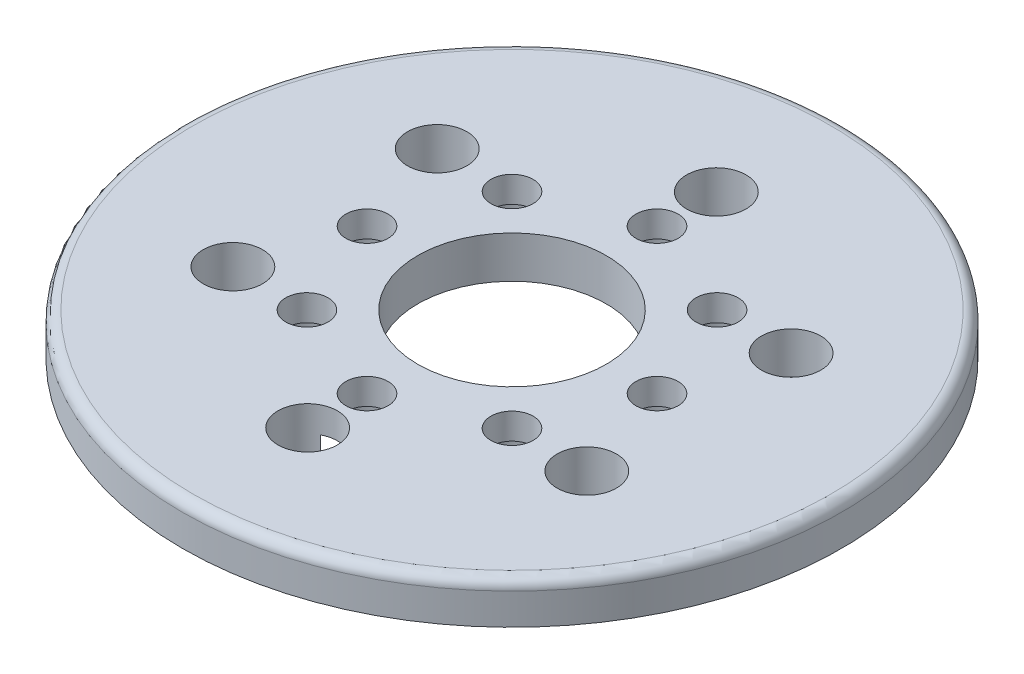
ISO-10303-21;
HEADER;
FILE_DESCRIPTION(('STEP AP214'),'2;1');
FILE_NAME('part.step','',(''),(''),'','','');
FILE_SCHEMA(('AUTOMOTIVE_DESIGN { 1 0 10303 214 1 1 1 1 }'));
ENDSEC;
DATA;
#1=APPLICATION_CONTEXT('core data for automotive mechanical design processes');
#2=APPLICATION_PROTOCOL_DEFINITION('international standard','automotive_design',2000,#1);
#3=PRODUCT_CONTEXT('',#1,'mechanical');
#4=PRODUCT('Part','Part','',(#3));
#5=PRODUCT_RELATED_PRODUCT_CATEGORY('part','',(#4));
#6=PRODUCT_DEFINITION_FORMATION('','',#4);
#7=PRODUCT_DEFINITION_CONTEXT('part definition',#1,'design');
#8=PRODUCT_DEFINITION('design','',#6,#7);
#9=PRODUCT_DEFINITION_SHAPE('','',#8);
#10=(LENGTH_UNIT() NAMED_UNIT(*) SI_UNIT(.MILLI.,.METRE.));
#11=(NAMED_UNIT(*) PLANE_ANGLE_UNIT() SI_UNIT($,.RADIAN.));
#12=(NAMED_UNIT(*) SI_UNIT($,.STERADIAN.) SOLID_ANGLE_UNIT());
#13=UNCERTAINTY_MEASURE_WITH_UNIT(LENGTH_MEASURE(1.E-05),#10,'distance_accuracy_value','');
#14=(GEOMETRIC_REPRESENTATION_CONTEXT(3) GLOBAL_UNCERTAINTY_ASSIGNED_CONTEXT((#13)) GLOBAL_UNIT_ASSIGNED_CONTEXT((#10,
#11,#12)) REPRESENTATION_CONTEXT('',''));
#15=CARTESIAN_POINT('',(0.,0.,0.));
#16=DIRECTION('',(0.,0.,1.));
#17=DIRECTION('',(1.,0.,0.));
#18=AXIS2_PLACEMENT_3D('',#15,#16,#17);
#19=CARTESIAN_POINT('',(7.77817459305193,3.175,7.77817459305212));
#20=DIRECTION('',(0.,-1.,0.));
#21=DIRECTION('',(0.,0.,-1.));
#22=AXIS2_PLACEMENT_3D('',#19,#20,#21);
#23=CYLINDRICAL_SURFACE('',#22,1.6);
#24=CARTESIAN_POINT('',(7.77817459305193,3.175,7.77817459305212));
#25=DIRECTION('',(0.,-1.,0.));
#26=DIRECTION('',(-0.707106781186539,0.,-0.707106781186556));
#27=AXIS2_PLACEMENT_3D('',#24,#25,#26);
#28=CIRCLE('',#27,1.6);
#29=CARTESIAN_POINT('',(6.64680374315347,3.175,6.64680374315363));
#30=VERTEX_POINT('',#29);
#31=EDGE_CURVE('E123',#30,#30,#28,.T.);
#32=ORIENTED_EDGE('',*,*,#31,.F.);
#33=EDGE_LOOP('',(#32));
#34=FACE_BOUND('',#33,.T.);
#35=CARTESIAN_POINT('',(7.77817459305193,1.2,7.77817459305212));
#36=DIRECTION('',(0.,-1.,0.));
#37=DIRECTION('',(0.,0.,-1.));
#38=AXIS2_PLACEMENT_3D('',#35,#36,#37);
#39=CIRCLE('',#38,1.6);
#40=CARTESIAN_POINT('',(7.77817459305193,1.2,6.17817459305212));
#41=VERTEX_POINT('',#40);
#42=EDGE_CURVE('E147',#41,#41,#39,.F.);
#43=ORIENTED_EDGE('',*,*,#42,.F.);
#44=EDGE_LOOP('',(#43));
#45=FACE_BOUND('',#44,.T.);
#46=ADVANCED_FACE('F32',(#34,#45),#23,.F.);
#47=CARTESIAN_POINT('',(11.,3.175,1.15218884181823E-13));
#48=DIRECTION('',(0.,-1.,0.));
#49=DIRECTION('',(0.,0.,-1.));
#50=AXIS2_PLACEMENT_3D('',#47,#48,#49);
#51=CYLINDRICAL_SURFACE('',#50,1.6);
#52=CARTESIAN_POINT('',(11.,3.175,1.15218884181823E-13));
#53=DIRECTION('',(0.,-1.,0.));
#54=DIRECTION('',(-1.,0.,0.));
#55=AXIS2_PLACEMENT_3D('',#52,#53,#54);
#56=CIRCLE('',#55,1.6);
#57=CARTESIAN_POINT('',(9.4,3.175,0.));
#58=VERTEX_POINT('',#57);
#59=EDGE_CURVE('E538',#58,#58,#56,.T.);
#60=ORIENTED_EDGE('',*,*,#59,.F.);
#61=EDGE_LOOP('',(#60));
#62=FACE_BOUND('',#61,.T.);
#63=CARTESIAN_POINT('',(11.,1.2,1.15218884181823E-13));
#64=DIRECTION('',(0.,-1.,0.));
#65=DIRECTION('',(0.,0.,-1.));
#66=AXIS2_PLACEMENT_3D('',#63,#64,#65);
#67=CIRCLE('',#66,1.6);
#68=CARTESIAN_POINT('',(11.,1.2,-1.59999999999989));
#69=VERTEX_POINT('',#68);
#70=EDGE_CURVE('E142',#69,#69,#67,.F.);
#71=ORIENTED_EDGE('',*,*,#70,.F.);
#72=EDGE_LOOP('',(#71));
#73=FACE_BOUND('',#72,.T.);
#74=ADVANCED_FACE('F168',(#62,#73),#51,.F.);
#75=CARTESIAN_POINT('',(7.77817459305209,3.175,-7.77817459305195));
#76=DIRECTION('',(0.,-1.,0.));
#77=DIRECTION('',(0.,0.,-1.));
#78=AXIS2_PLACEMENT_3D('',#75,#76,#77);
#79=CYLINDRICAL_SURFACE('',#78,1.6);
#80=CARTESIAN_POINT('',(7.77817459305209,3.175,-7.77817459305195));
#81=DIRECTION('',(0.,-1.,0.));
#82=DIRECTION('',(-0.707106781186554,0.,0.707106781186541));
#83=AXIS2_PLACEMENT_3D('',#80,#81,#82);
#84=CIRCLE('',#83,1.6);
#85=CARTESIAN_POINT('',(6.6468037431536,3.175,-6.64680374315349));
#86=VERTEX_POINT('',#85);
#87=EDGE_CURVE('E541',#86,#86,#84,.T.);
#88=ORIENTED_EDGE('',*,*,#87,.F.);
#89=EDGE_LOOP('',(#88));
#90=FACE_BOUND('',#89,.T.);
#91=CARTESIAN_POINT('',(7.77817459305209,1.2,-7.77817459305195));
#92=DIRECTION('',(0.,-1.,0.));
#93=DIRECTION('',(0.,0.,-1.));
#94=AXIS2_PLACEMENT_3D('',#91,#92,#93);
#95=CIRCLE('',#94,1.6);
#96=CARTESIAN_POINT('',(7.77817459305209,1.2,-9.37817459305195));
#97=VERTEX_POINT('',#96);
#98=EDGE_CURVE('E82',#97,#97,#95,.F.);
#99=ORIENTED_EDGE('',*,*,#98,.F.);
#100=EDGE_LOOP('',(#99));
#101=FACE_BOUND('',#100,.T.);
#102=ADVANCED_FACE('F174',(#90,#101),#79,.F.);
#103=CARTESIAN_POINT('',(0.,3.175,-11.));
#104=DIRECTION('',(0.,-1.,0.));
#105=DIRECTION('',(0.,0.,-1.));
#106=AXIS2_PLACEMENT_3D('',#103,#104,#105);
#107=CYLINDRICAL_SURFACE('',#106,1.6);
#108=CARTESIAN_POINT('',(0.,3.175,-11.));
#109=DIRECTION('',(0.,-1.,0.));
#110=DIRECTION('',(0.,0.,1.));
#111=AXIS2_PLACEMENT_3D('',#108,#109,#110);
#112=CIRCLE('',#111,1.6);
#113=CARTESIAN_POINT('',(0.,3.175,-9.4));
#114=VERTEX_POINT('',#113);
#115=EDGE_CURVE('E544',#114,#114,#112,.T.);
#116=ORIENTED_EDGE('',*,*,#115,.F.);
#117=EDGE_LOOP('',(#116));
#118=FACE_BOUND('',#117,.T.);
#119=CARTESIAN_POINT('',(0.,1.2,-11.));
#120=DIRECTION('',(0.,-1.,0.));
#121=DIRECTION('',(0.,0.,-1.));
#122=AXIS2_PLACEMENT_3D('',#119,#120,#121);
#123=CIRCLE('',#122,1.6);
#124=CARTESIAN_POINT('',(0.,1.2,-12.6));
#125=VERTEX_POINT('',#124);
#126=EDGE_CURVE('E135',#125,#125,#123,.F.);
#127=ORIENTED_EDGE('',*,*,#126,.F.);
#128=EDGE_LOOP('',(#127));
#129=FACE_BOUND('',#128,.T.);
#130=ADVANCED_FACE('F185',(#118,#129),#107,.F.);
#131=CARTESIAN_POINT('',(-7.77817459305198,3.175,-7.77817459305206));
#132=DIRECTION('',(0.,-1.,0.));
#133=DIRECTION('',(0.,0.,-1.));
#134=AXIS2_PLACEMENT_3D('',#131,#132,#133);
#135=CYLINDRICAL_SURFACE('',#134,1.6);
#136=CARTESIAN_POINT('',(-7.77817459305198,3.175,-7.77817459305206));
#137=DIRECTION('',(0.,-1.,0.));
#138=DIRECTION('',(0.707106781186544,0.,0.707106781186551));
#139=AXIS2_PLACEMENT_3D('',#136,#137,#138);
#140=CIRCLE('',#139,1.6);
#141=CARTESIAN_POINT('',(-6.64680374315351,3.175,-6.64680374315358));
#142=VERTEX_POINT('',#141);
#143=EDGE_CURVE('E547',#142,#142,#140,.T.);
#144=ORIENTED_EDGE('',*,*,#143,.F.);
#145=EDGE_LOOP('',(#144));
#146=FACE_BOUND('',#145,.T.);
#147=CARTESIAN_POINT('',(-7.77817459305198,1.2,-7.77817459305206));
#148=DIRECTION('',(0.,-1.,0.));
#149=DIRECTION('',(0.,0.,-1.));
#150=AXIS2_PLACEMENT_3D('',#147,#148,#149);
#151=CIRCLE('',#150,1.6);
#152=CARTESIAN_POINT('',(-7.77817459305198,1.2,-9.37817459305206));
#153=VERTEX_POINT('',#152);
#154=EDGE_CURVE('E130',#153,#153,#151,.F.);
#155=ORIENTED_EDGE('',*,*,#154,.F.);
#156=EDGE_LOOP('',(#155));
#157=FACE_BOUND('',#156,.T.);
#158=ADVANCED_FACE('F189',(#146,#157),#135,.F.);
#159=CARTESIAN_POINT('',(-11.,3.175,0.));
#160=DIRECTION('',(0.,-1.,0.));
#161=DIRECTION('',(0.,0.,-1.));
#162=AXIS2_PLACEMENT_3D('',#159,#160,#161);
#163=CYLINDRICAL_SURFACE('',#162,1.6);
#164=CARTESIAN_POINT('',(-11.,3.175,0.));
#165=DIRECTION('',(0.,-1.,0.));
#166=DIRECTION('',(1.,0.,0.));
#167=AXIS2_PLACEMENT_3D('',#164,#165,#166);
#168=CIRCLE('',#167,1.6);
#169=CARTESIAN_POINT('',(-9.4,3.175,0.));
#170=VERTEX_POINT('',#169);
#171=EDGE_CURVE('E550',#170,#170,#168,.T.);
#172=ORIENTED_EDGE('',*,*,#171,.F.);
#173=EDGE_LOOP('',(#172));
#174=FACE_BOUND('',#173,.T.);
#175=CARTESIAN_POINT('',(-11.,1.2,0.));
#176=DIRECTION('',(0.,-1.,0.));
#177=DIRECTION('',(0.,0.,-1.));
#178=AXIS2_PLACEMENT_3D('',#175,#176,#177);
#179=CIRCLE('',#178,1.6);
#180=CARTESIAN_POINT('',(-11.,1.2,-1.60000000000004));
#181=VERTEX_POINT('',#180);
#182=EDGE_CURVE('E125',#181,#181,#179,.F.);
#183=ORIENTED_EDGE('',*,*,#182,.F.);
#184=EDGE_LOOP('',(#183));
#185=FACE_BOUND('',#184,.T.);
#186=ADVANCED_FACE('F193',(#174,#185),#163,.F.);
#187=CARTESIAN_POINT('',(-7.77817459305204,3.175,7.77817459305201));
#188=DIRECTION('',(0.,-1.,0.));
#189=DIRECTION('',(0.,0.,-1.));
#190=AXIS2_PLACEMENT_3D('',#187,#188,#189);
#191=CYLINDRICAL_SURFACE('',#190,1.6);
#192=CARTESIAN_POINT('',(-7.77817459305204,3.175,7.77817459305201));
#193=DIRECTION('',(0.,-1.,0.));
#194=DIRECTION('',(0.707106781186549,0.,-0.707106781186546));
#195=AXIS2_PLACEMENT_3D('',#192,#193,#194);
#196=CIRCLE('',#195,1.6);
#197=CARTESIAN_POINT('',(-6.64680374315356,3.175,6.64680374315354));
#198=VERTEX_POINT('',#197);
#199=EDGE_CURVE('E553',#198,#198,#196,.T.);
#200=ORIENTED_EDGE('',*,*,#199,.F.);
#201=EDGE_LOOP('',(#200));
#202=FACE_BOUND('',#201,.T.);
#203=CARTESIAN_POINT('',(-7.77817459305204,1.2,7.77817459305201));
#204=DIRECTION('',(0.,-1.,0.));
#205=DIRECTION('',(0.,0.,-1.));
#206=AXIS2_PLACEMENT_3D('',#203,#204,#205);
#207=CIRCLE('',#206,1.6);
#208=CARTESIAN_POINT('',(-7.77817459305204,1.2,6.17817459305201));
#209=VERTEX_POINT('',#208);
#210=EDGE_CURVE('E120',#209,#209,#207,.F.);
#211=ORIENTED_EDGE('',*,*,#210,.F.);
#212=EDGE_LOOP('',(#211));
#213=FACE_BOUND('',#212,.T.);
#214=ADVANCED_FACE('F197',(#202,#213),#191,.F.);
#215=CARTESIAN_POINT('',(0.,3.175,11.));
#216=DIRECTION('',(0.,-1.,0.));
#217=DIRECTION('',(0.,0.,-1.));
#218=AXIS2_PLACEMENT_3D('',#215,#216,#217);
#219=CYLINDRICAL_SURFACE('',#218,1.6);
#220=CARTESIAN_POINT('',(0.,3.175,11.));
#221=DIRECTION('',(0.,-1.,0.));
#222=DIRECTION('',(0.,0.,-1.));
#223=AXIS2_PLACEMENT_3D('',#220,#221,#222);
#224=CIRCLE('',#223,1.6);
#225=CARTESIAN_POINT('',(0.,3.175,9.4));
#226=VERTEX_POINT('',#225);
#227=EDGE_CURVE('E560',#226,#226,#224,.T.);
#228=ORIENTED_EDGE('',*,*,#227,.F.);
#229=EDGE_LOOP('',(#228));
#230=FACE_BOUND('',#229,.T.);
#231=CARTESIAN_POINT('',(0.,1.2,11.));
#232=DIRECTION('',(0.,-1.,0.));
#233=DIRECTION('',(0.,0.,-1.));
#234=AXIS2_PLACEMENT_3D('',#231,#232,#233);
#235=CIRCLE('',#234,1.6);
#236=CARTESIAN_POINT('',(0.,1.2,9.4));
#237=VERTEX_POINT('',#236);
#238=EDGE_CURVE('E112',#237,#237,#235,.F.);
#239=ORIENTED_EDGE('',*,*,#238,.F.);
#240=EDGE_LOOP('',(#239));
#241=FACE_BOUND('',#240,.T.);
#242=ADVANCED_FACE('F201',(#230,#241),#219,.F.);
#243=CARTESIAN_POINT('',(0.,3.175,0.));
#244=DIRECTION('',(0.,1.,0.));
#245=DIRECTION('',(0.,0.,1.));
#246=AXIS2_PLACEMENT_3D('',#243,#244,#245);
#247=PLANE('',#246);
#248=CARTESIAN_POINT('',(0.,3.175,0.));
#249=DIRECTION('',(0.,1.,0.));
#250=DIRECTION('',(0.,0.,1.));
#251=AXIS2_PLACEMENT_3D('',#248,#249,#250);
#252=CIRCLE('',#251,24.2);
#253=CARTESIAN_POINT('',(0.,3.175,24.2));
#254=VERTEX_POINT('',#253);
#255=EDGE_CURVE('E40',#254,#254,#252,.T.);
#256=ORIENTED_EDGE('',*,*,#255,.T.);
#257=EDGE_LOOP('',(#256));
#258=FACE_BOUND('',#257,.T.);
#259=ORIENTED_EDGE('',*,*,#31,.T.);
#260=EDGE_LOOP('',(#259));
#261=FACE_BOUND('',#260,.T.);
#262=ORIENTED_EDGE('',*,*,#59,.T.);
#263=EDGE_LOOP('',(#262));
#264=FACE_BOUND('',#263,.T.);
#265=ORIENTED_EDGE('',*,*,#87,.T.);
#266=EDGE_LOOP('',(#265));
#267=FACE_BOUND('',#266,.T.);
#268=ORIENTED_EDGE('',*,*,#115,.T.);
#269=EDGE_LOOP('',(#268));
#270=FACE_BOUND('',#269,.T.);
#271=ORIENTED_EDGE('',*,*,#143,.T.);
#272=EDGE_LOOP('',(#271));
#273=FACE_BOUND('',#272,.T.);
#274=ORIENTED_EDGE('',*,*,#171,.T.);
#275=EDGE_LOOP('',(#274));
#276=FACE_BOUND('',#275,.T.);
#277=ORIENTED_EDGE('',*,*,#199,.T.);
#278=EDGE_LOOP('',(#277));
#279=FACE_BOUND('',#278,.T.);
#280=ORIENTED_EDGE('',*,*,#227,.T.);
#281=EDGE_LOOP('',(#280));
#282=FACE_BOUND('',#281,.T.);
#283=CARTESIAN_POINT('',(-13.4233937586587,3.175,-7.75000000000016));
#284=DIRECTION('',(0.,1.,0.));
#285=DIRECTION('',(0.866025403784433,0.,0.50000000000001));
#286=AXIS2_PLACEMENT_3D('',#283,#284,#285);
#287=CIRCLE('',#286,2.25);
#288=CARTESIAN_POINT('',(-11.4748366001437,3.175,-6.62500000000013));
#289=VERTEX_POINT('',#288);
#290=EDGE_CURVE('E563',#289,#289,#287,.T.);
#291=ORIENTED_EDGE('',*,*,#290,.F.);
#292=EDGE_LOOP('',(#291));
#293=FACE_BOUND('',#292,.T.);
#294=CARTESIAN_POINT('',(-13.4233937586589,3.175,7.74999999999987));
#295=DIRECTION('',(0.,1.,0.));
#296=DIRECTION('',(0.866025403784443,0.,-0.499999999999992));
#297=AXIS2_PLACEMENT_3D('',#294,#295,#296);
#298=CIRCLE('',#297,2.25);
#299=CARTESIAN_POINT('',(-11.4748366001439,3.175,6.62499999999989));
#300=VERTEX_POINT('',#299);
#301=EDGE_CURVE('E567',#300,#300,#298,.T.);
#302=ORIENTED_EDGE('',*,*,#301,.F.);
#303=EDGE_LOOP('',(#302));
#304=FACE_BOUND('',#303,.T.);
#305=CARTESIAN_POINT('',(0.,3.175,15.5));
#306=DIRECTION('',(0.,1.,0.));
#307=DIRECTION('',(0.,0.,-1.));
#308=AXIS2_PLACEMENT_3D('',#305,#306,#307);
#309=CIRCLE('',#308,2.25);
#310=CARTESIAN_POINT('',(0.,3.175,13.25));
#311=VERTEX_POINT('',#310);
#312=EDGE_CURVE('E573',#311,#311,#309,.T.);
#313=ORIENTED_EDGE('',*,*,#312,.F.);
#314=EDGE_LOOP('',(#313));
#315=FACE_BOUND('',#314,.T.);
#316=CARTESIAN_POINT('',(13.4233937586588,3.175,7.75000000000006));
#317=DIRECTION('',(0.,1.,0.));
#318=DIRECTION('',(-0.866025403784436,0.,-0.500000000000004));
#319=AXIS2_PLACEMENT_3D('',#316,#317,#318);
#320=CIRCLE('',#319,2.25);
#321=CARTESIAN_POINT('',(11.4748366001438,3.175,6.62500000000005));
#322=VERTEX_POINT('',#321);
#323=EDGE_CURVE('E579',#322,#322,#320,.T.);
#324=ORIENTED_EDGE('',*,*,#323,.F.);
#325=EDGE_LOOP('',(#324));
#326=FACE_BOUND('',#325,.T.);
#327=CARTESIAN_POINT('',(13.4233937586588,3.175,-7.74999999999997));
#328=DIRECTION('',(0.,1.,0.));
#329=DIRECTION('',(-0.86602540378444,0.,0.499999999999998));
#330=AXIS2_PLACEMENT_3D('',#327,#328,#329);
#331=CIRCLE('',#330,2.25);
#332=CARTESIAN_POINT('',(11.4748366001438,3.175,-6.62499999999997));
#333=VERTEX_POINT('',#332);
#334=EDGE_CURVE('E103',#333,#333,#331,.T.);
#335=ORIENTED_EDGE('',*,*,#334,.F.);
#336=EDGE_LOOP('',(#335));
#337=FACE_BOUND('',#336,.T.);
#338=CARTESIAN_POINT('',(0.,3.175,-15.5));
#339=DIRECTION('',(0.,1.,0.));
#340=DIRECTION('',(0.,0.,1.));
#341=AXIS2_PLACEMENT_3D('',#338,#339,#340);
#342=CIRCLE('',#341,2.25);
#343=CARTESIAN_POINT('',(0.,3.175,-13.25));
#344=VERTEX_POINT('',#343);
#345=EDGE_CURVE('E94',#344,#344,#342,.T.);
#346=ORIENTED_EDGE('',*,*,#345,.F.);
#347=EDGE_LOOP('',(#346));
#348=FACE_BOUND('',#347,.T.);
#349=CARTESIAN_POINT('',(0.,3.175,0.));
#350=DIRECTION('',(0.,1.,0.));
#351=DIRECTION('',(0.,0.,1.));
#352=AXIS2_PLACEMENT_3D('',#349,#350,#351);
#353=CIRCLE('',#352,7.15);
#354=CARTESIAN_POINT('',(0.,3.175,7.15));
#355=VERTEX_POINT('',#354);
#356=EDGE_CURVE('E97',#355,#355,#353,.T.);
#357=ORIENTED_EDGE('',*,*,#356,.F.);
#358=EDGE_LOOP('',(#357));
#359=FACE_BOUND('',#358,.T.);
#360=ADVANCED_FACE('F154',(#258,#261,#264,#267,#270,#273,#276,#279,#282,#293,#304,#315,#326,
#337,#348,#359),#247,.T.);
#361=CARTESIAN_POINT('',(0.,0.,0.));
#362=DIRECTION('',(0.,1.,0.));
#363=DIRECTION('',(0.,0.,1.));
#364=AXIS2_PLACEMENT_3D('',#361,#362,#363);
#365=PLANE('',#364);
#366=CARTESIAN_POINT('',(7.77817459305193,0.,7.77817459305212));
#367=DIRECTION('',(0.,-1.,0.));
#368=DIRECTION('',(-0.707106781186539,0.,-0.707106781186556));
#369=AXIS2_PLACEMENT_3D('',#366,#367,#368);
#370=CIRCLE('',#369,2.7);
#371=CARTESIAN_POINT('',(5.86898628384827,0.,5.86898628384841));
#372=VERTEX_POINT('',#371);
#373=EDGE_CURVE('E508',#372,#372,#370,.T.);
#374=ORIENTED_EDGE('',*,*,#373,.F.);
#375=EDGE_LOOP('',(#374));
#376=FACE_BOUND('',#375,.T.);
#377=CARTESIAN_POINT('',(11.,0.,1.15218884181823E-13));
#378=DIRECTION('',(0.,-1.,0.));
#379=DIRECTION('',(-1.,0.,0.));
#380=AXIS2_PLACEMENT_3D('',#377,#378,#379);
#381=CIRCLE('',#380,2.7);
#382=CARTESIAN_POINT('',(8.3,0.,0.));
#383=VERTEX_POINT('',#382);
#384=EDGE_CURVE('E149',#383,#383,#381,.T.);
#385=ORIENTED_EDGE('',*,*,#384,.F.);
#386=EDGE_LOOP('',(#385));
#387=FACE_BOUND('',#386,.T.);
#388=CARTESIAN_POINT('',(7.77817459305209,0.,-7.77817459305195));
#389=DIRECTION('',(0.,-1.,0.));
#390=DIRECTION('',(-0.707106781186554,0.,0.707106781186541));
#391=AXIS2_PLACEMENT_3D('',#388,#389,#390);
#392=CIRCLE('',#391,2.7);
#393=CARTESIAN_POINT('',(5.8689862838484,0.,-5.86898628384829));
#394=VERTEX_POINT('',#393);
#395=EDGE_CURVE('E145',#394,#394,#392,.T.);
#396=ORIENTED_EDGE('',*,*,#395,.F.);
#397=EDGE_LOOP('',(#396));
#398=FACE_BOUND('',#397,.T.);
#399=CARTESIAN_POINT('',(-7.77817459305198,0.,-7.77817459305206));
#400=DIRECTION('',(0.,-1.,0.));
#401=DIRECTION('',(0.707106781186544,0.,0.707106781186551));
#402=AXIS2_PLACEMENT_3D('',#399,#400,#401);
#403=CIRCLE('',#402,2.7);
#404=CARTESIAN_POINT('',(-5.86898628384831,0.,-5.86898628384837));
#405=VERTEX_POINT('',#404);
#406=EDGE_CURVE('E523',#405,#405,#403,.T.);
#407=ORIENTED_EDGE('',*,*,#406,.F.);
#408=EDGE_LOOP('',(#407));
#409=FACE_BOUND('',#408,.T.);
#410=CARTESIAN_POINT('',(-11.,0.,0.));
#411=DIRECTION('',(0.,-1.,0.));
#412=DIRECTION('',(1.,0.,0.));
#413=AXIS2_PLACEMENT_3D('',#410,#411,#412);
#414=CIRCLE('',#413,2.7);
#415=CARTESIAN_POINT('',(-8.3,0.,0.));
#416=VERTEX_POINT('',#415);
#417=EDGE_CURVE('E133',#416,#416,#414,.T.);
#418=ORIENTED_EDGE('',*,*,#417,.F.);
#419=EDGE_LOOP('',(#418));
#420=FACE_BOUND('',#419,.T.);
#421=CARTESIAN_POINT('',(-7.77817459305204,0.,7.77817459305201));
#422=DIRECTION('',(0.,-1.,0.));
#423=DIRECTION('',(0.707106781186549,0.,-0.707106781186546));
#424=AXIS2_PLACEMENT_3D('',#421,#422,#423);
#425=CIRCLE('',#424,2.7);
#426=CARTESIAN_POINT('',(-5.86898628384835,0.,5.86898628384833));
#427=VERTEX_POINT('',#426);
#428=EDGE_CURVE('E128',#427,#427,#425,.T.);
#429=ORIENTED_EDGE('',*,*,#428,.F.);
#430=EDGE_LOOP('',(#429));
#431=FACE_BOUND('',#430,.T.);
#432=CARTESIAN_POINT('',(-13.4233937586587,0.,-7.75000000000016));
#433=DIRECTION('',(0.,1.,0.));
#434=DIRECTION('',(0.866025403784433,0.,0.50000000000001));
#435=AXIS2_PLACEMENT_3D('',#432,#433,#434);
#436=CIRCLE('',#435,2.25);
#437=CARTESIAN_POINT('',(-11.4748366001437,0.,-6.62500000000013));
#438=VERTEX_POINT('',#437);
#439=EDGE_CURVE('E564',#438,#438,#436,.T.);
#440=ORIENTED_EDGE('',*,*,#439,.T.);
#441=EDGE_LOOP('',(#440));
#442=FACE_BOUND('',#441,.T.);
#443=CARTESIAN_POINT('',(-13.4233937586589,0.,7.74999999999987));
#444=DIRECTION('',(0.,1.,0.));
#445=DIRECTION('',(0.866025403784443,0.,-0.499999999999992));
#446=AXIS2_PLACEMENT_3D('',#443,#444,#445);
#447=CIRCLE('',#446,2.25);
#448=CARTESIAN_POINT('',(-11.4748366001439,0.,6.62499999999989));
#449=VERTEX_POINT('',#448);
#450=EDGE_CURVE('E570',#449,#449,#447,.T.);
#451=ORIENTED_EDGE('',*,*,#450,.T.);
#452=EDGE_LOOP('',(#451));
#453=FACE_BOUND('',#452,.T.);
#454=CARTESIAN_POINT('',(0.,0.,15.5));
#455=DIRECTION('',(0.,1.,0.));
#456=DIRECTION('',(0.,0.,-1.));
#457=AXIS2_PLACEMENT_3D('',#454,#455,#456);
#458=CIRCLE('',#457,2.25);
#459=CARTESIAN_POINT('',(-1.02591118036602,0.,13.4975));
#460=VERTEX_POINT('',#459);
#461=CARTESIAN_POINT('',(1.02591118036602,0.,13.4975));
#462=VERTEX_POINT('',#461);
#463=EDGE_CURVE('E576',#460,#462,#458,.T.);
#464=ORIENTED_EDGE('',*,*,#463,.T.);
#465=CARTESIAN_POINT('',(0.,0.,11.));
#466=DIRECTION('',(0.,-1.,0.));
#467=DIRECTION('',(0.,0.,-1.));
#468=AXIS2_PLACEMENT_3D('',#465,#466,#467);
#469=CIRCLE('',#468,2.7);
#470=EDGE_CURVE('E556',#460,#462,#469,.T.);
#471=ORIENTED_EDGE('',*,*,#470,.F.);
#472=EDGE_LOOP('',(#464,#471));
#473=FACE_BOUND('',#472,.T.);
#474=CARTESIAN_POINT('',(13.4233937586588,0.,7.75000000000006));
#475=DIRECTION('',(0.,1.,0.));
#476=DIRECTION('',(-0.866025403784436,0.,-0.500000000000004));
#477=AXIS2_PLACEMENT_3D('',#474,#475,#476);
#478=CIRCLE('',#477,2.25);
#479=CARTESIAN_POINT('',(11.4748366001438,0.,6.62500000000005));
#480=VERTEX_POINT('',#479);
#481=EDGE_CURVE('E582',#480,#480,#478,.T.);
#482=ORIENTED_EDGE('',*,*,#481,.T.);
#483=EDGE_LOOP('',(#482));
#484=FACE_BOUND('',#483,.T.);
#485=CARTESIAN_POINT('',(13.4233937586588,0.,-7.74999999999997));
#486=DIRECTION('',(0.,1.,0.));
#487=DIRECTION('',(-0.86602540378444,0.,0.499999999999998));
#488=AXIS2_PLACEMENT_3D('',#485,#486,#487);
#489=CIRCLE('',#488,2.25);
#490=CARTESIAN_POINT('',(11.4748366001438,0.,-6.62499999999997));
#491=VERTEX_POINT('',#490);
#492=EDGE_CURVE('E100',#491,#491,#489,.T.);
#493=ORIENTED_EDGE('',*,*,#492,.T.);
#494=EDGE_LOOP('',(#493));
#495=FACE_BOUND('',#494,.T.);
#496=CARTESIAN_POINT('',(0.,0.,-15.5));
#497=DIRECTION('',(0.,1.,0.));
#498=DIRECTION('',(0.,0.,1.));
#499=AXIS2_PLACEMENT_3D('',#496,#497,#498);
#500=CIRCLE('',#499,2.25);
#501=CARTESIAN_POINT('',(1.02591118036602,0.,-13.4975));
#502=VERTEX_POINT('',#501);
#503=CARTESIAN_POINT('',(-1.02591118036602,0.,-13.4975));
#504=VERTEX_POINT('',#503);
#505=EDGE_CURVE('E87',#502,#504,#500,.T.);
#506=ORIENTED_EDGE('',*,*,#505,.T.);
#507=CARTESIAN_POINT('',(0.,0.,-11.));
#508=DIRECTION('',(0.,-1.,0.));
#509=DIRECTION('',(0.,0.,1.));
#510=AXIS2_PLACEMENT_3D('',#507,#508,#509);
#511=CIRCLE('',#510,2.7);
#512=EDGE_CURVE('E72',#502,#504,#511,.T.);
#513=ORIENTED_EDGE('',*,*,#512,.F.);
#514=EDGE_LOOP('',(#506,#513));
#515=FACE_BOUND('',#514,.T.);
#516=CARTESIAN_POINT('',(0.,0.,0.));
#517=DIRECTION('',(0.,1.,0.));
#518=DIRECTION('',(0.,0.,1.));
#519=AXIS2_PLACEMENT_3D('',#516,#517,#518);
#520=CIRCLE('',#519,25.);
#521=CARTESIAN_POINT('',(0.,0.,25.));
#522=VERTEX_POINT('',#521);
#523=EDGE_CURVE('E107',#522,#522,#520,.T.);
#524=ORIENTED_EDGE('',*,*,#523,.F.);
#525=EDGE_LOOP('',(#524));
#526=FACE_BOUND('',#525,.T.);
#527=CARTESIAN_POINT('',(0.,0.,0.));
#528=DIRECTION('',(0.,1.,0.));
#529=DIRECTION('',(0.,0.,1.));
#530=AXIS2_PLACEMENT_3D('',#527,#528,#529);
#531=CIRCLE('',#530,7.15);
#532=CARTESIAN_POINT('',(0.,0.,7.15));
#533=VERTEX_POINT('',#532);
#534=EDGE_CURVE('E93',#533,#533,#531,.T.);
#535=ORIENTED_EDGE('',*,*,#534,.T.);
#536=EDGE_LOOP('',(#535));
#537=FACE_BOUND('',#536,.T.);
#538=ADVANCED_FACE('F91',(#376,#387,#398,#409,#420,#431,#442,#453,#473,#484,#495,#515,#526,
#537),#365,.F.);
#539=CARTESIAN_POINT('',(0.,3.175,0.));
#540=DIRECTION('',(0.,-1.,0.));
#541=DIRECTION('',(0.,0.,-1.));
#542=AXIS2_PLACEMENT_3D('',#539,#540,#541);
#543=CYLINDRICAL_SURFACE('',#542,25.);
#544=CARTESIAN_POINT('',(0.,2.375,0.));
#545=DIRECTION('',(0.,1.,0.));
#546=DIRECTION('',(0.,0.,1.));
#547=AXIS2_PLACEMENT_3D('',#544,#545,#546);
#548=CIRCLE('',#547,25.);
#549=CARTESIAN_POINT('',(0.,2.375,25.));
#550=VERTEX_POINT('',#549);
#551=EDGE_CURVE('E11',#550,#550,#548,.F.);
#552=ORIENTED_EDGE('',*,*,#551,.T.);
#553=EDGE_LOOP('',(#552));
#554=FACE_BOUND('',#553,.T.);
#555=ORIENTED_EDGE('',*,*,#523,.T.);
#556=EDGE_LOOP('',(#555));
#557=FACE_BOUND('',#556,.T.);
#558=ADVANCED_FACE('F240',(#554,#557),#543,.T.);
#559=CARTESIAN_POINT('',(0.,3.175,0.));
#560=DIRECTION('',(0.,-1.,0.));
#561=DIRECTION('',(0.,0.,-1.));
#562=AXIS2_PLACEMENT_3D('',#559,#560,#561);
#563=CYLINDRICAL_SURFACE('',#562,7.15);
#564=ORIENTED_EDGE('',*,*,#356,.T.);
#565=EDGE_LOOP('',(#564));
#566=FACE_BOUND('',#565,.T.);
#567=ORIENTED_EDGE('',*,*,#534,.F.);
#568=EDGE_LOOP('',(#567));
#569=FACE_BOUND('',#568,.T.);
#570=ADVANCED_FACE('F237',(#566,#569),#563,.F.);
#571=CARTESIAN_POINT('',(0.,0.,-15.5));
#572=DIRECTION('',(0.,1.,0.));
#573=DIRECTION('',(0.,0.,1.));
#574=AXIS2_PLACEMENT_3D('',#571,#572,#573);
#575=CYLINDRICAL_SURFACE('',#574,2.25);
#576=ORIENTED_EDGE('',*,*,#505,.F.);
#577=DIRECTION('',(0.,-1.,0.));
#578=VECTOR('',#577,1.);
#579=CARTESIAN_POINT('',(1.02591118036602,0.6,-13.4975));
#580=LINE('',#579,#578);
#581=CARTESIAN_POINT('',(1.02591118036602,1.2,-13.4975));
#582=VERTEX_POINT('',#581);
#583=EDGE_CURVE('E78',#502,#582,#580,.F.);
#584=ORIENTED_EDGE('',*,*,#583,.T.);
#585=CARTESIAN_POINT('',(0.,1.2,-15.5));
#586=DIRECTION('',(0.,-1.,0.));
#587=DIRECTION('',(0.,0.,-1.));
#588=AXIS2_PLACEMENT_3D('',#585,#586,#587);
#589=CIRCLE('',#588,2.25);
#590=CARTESIAN_POINT('',(-1.02591118036602,1.2,-13.4975));
#591=VERTEX_POINT('',#590);
#592=EDGE_CURVE('E88',#591,#582,#589,.F.);
#593=ORIENTED_EDGE('',*,*,#592,.F.);
#594=DIRECTION('',(0.,-1.,0.));
#595=VECTOR('',#594,1.);
#596=CARTESIAN_POINT('',(-1.02591118036602,0.6,-13.4975));
#597=LINE('',#596,#595);
#598=EDGE_CURVE('E75',#591,#504,#597,.T.);
#599=ORIENTED_EDGE('',*,*,#598,.T.);
#600=EDGE_LOOP('',(#576,#584,#593,#599));
#601=FACE_BOUND('',#600,.T.);
#602=ORIENTED_EDGE('',*,*,#345,.T.);
#603=EDGE_LOOP('',(#602));
#604=FACE_BOUND('',#603,.T.);
#605=ADVANCED_FACE('F85',(#601,#604),#575,.F.);
#606=CARTESIAN_POINT('',(13.4233937586588,0.,-7.74999999999997));
#607=DIRECTION('',(0.,1.,0.));
#608=DIRECTION('',(0.,0.,1.));
#609=AXIS2_PLACEMENT_3D('',#606,#607,#608);
#610=CYLINDRICAL_SURFACE('',#609,2.25);
#611=ORIENTED_EDGE('',*,*,#492,.F.);
#612=EDGE_LOOP('',(#611));
#613=FACE_BOUND('',#612,.T.);
#614=ORIENTED_EDGE('',*,*,#334,.T.);
#615=EDGE_LOOP('',(#614));
#616=FACE_BOUND('',#615,.T.);
#617=ADVANCED_FACE('F230',(#613,#616),#610,.F.);
#618=CARTESIAN_POINT('',(13.4233937586588,0.,7.75000000000006));
#619=DIRECTION('',(0.,1.,0.));
#620=DIRECTION('',(0.,0.,1.));
#621=AXIS2_PLACEMENT_3D('',#618,#619,#620);
#622=CYLINDRICAL_SURFACE('',#621,2.25);
#623=ORIENTED_EDGE('',*,*,#481,.F.);
#624=EDGE_LOOP('',(#623));
#625=FACE_BOUND('',#624,.T.);
#626=ORIENTED_EDGE('',*,*,#323,.T.);
#627=EDGE_LOOP('',(#626));
#628=FACE_BOUND('',#627,.T.);
#629=ADVANCED_FACE('F226',(#625,#628),#622,.F.);
#630=CARTESIAN_POINT('',(0.,0.,15.5));
#631=DIRECTION('',(0.,1.,0.));
#632=DIRECTION('',(0.,0.,1.));
#633=AXIS2_PLACEMENT_3D('',#630,#631,#632);
#634=CYLINDRICAL_SURFACE('',#633,2.25);
#635=ORIENTED_EDGE('',*,*,#463,.F.);
#636=DIRECTION('',(0.,-1.,0.));
#637=VECTOR('',#636,1.);
#638=CARTESIAN_POINT('',(-1.02591118036602,0.6,13.4975));
#639=LINE('',#638,#637);
#640=CARTESIAN_POINT('',(-1.02591118036602,1.2,13.4975));
#641=VERTEX_POINT('',#640);
#642=EDGE_CURVE('E89',#460,#641,#639,.F.);
#643=ORIENTED_EDGE('',*,*,#642,.T.);
#644=CARTESIAN_POINT('',(0.,1.2,15.5));
#645=DIRECTION('',(0.,-1.,0.));
#646=DIRECTION('',(0.,0.,-1.));
#647=AXIS2_PLACEMENT_3D('',#644,#645,#646);
#648=CIRCLE('',#647,2.25);
#649=CARTESIAN_POINT('',(1.02591118036602,1.2,13.4975));
#650=VERTEX_POINT('',#649);
#651=EDGE_CURVE('E115',#650,#641,#648,.F.);
#652=ORIENTED_EDGE('',*,*,#651,.F.);
#653=DIRECTION('',(0.,-1.,0.));
#654=VECTOR('',#653,1.);
#655=CARTESIAN_POINT('',(1.02591118036602,0.6,13.4975));
#656=LINE('',#655,#654);
#657=EDGE_CURVE('E111',#650,#462,#656,.T.);
#658=ORIENTED_EDGE('',*,*,#657,.T.);
#659=EDGE_LOOP('',(#635,#643,#652,#658));
#660=FACE_BOUND('',#659,.T.);
#661=ORIENTED_EDGE('',*,*,#312,.T.);
#662=EDGE_LOOP('',(#661));
#663=FACE_BOUND('',#662,.T.);
#664=ADVANCED_FACE('F222',(#660,#663),#634,.F.);
#665=CARTESIAN_POINT('',(-13.4233937586589,0.,7.74999999999987));
#666=DIRECTION('',(0.,1.,0.));
#667=DIRECTION('',(0.,0.,1.));
#668=AXIS2_PLACEMENT_3D('',#665,#666,#667);
#669=CYLINDRICAL_SURFACE('',#668,2.25);
#670=ORIENTED_EDGE('',*,*,#450,.F.);
#671=EDGE_LOOP('',(#670));
#672=FACE_BOUND('',#671,.T.);
#673=ORIENTED_EDGE('',*,*,#301,.T.);
#674=EDGE_LOOP('',(#673));
#675=FACE_BOUND('',#674,.T.);
#676=ADVANCED_FACE('F218',(#672,#675),#669,.F.);
#677=CARTESIAN_POINT('',(-13.4233937586587,0.,-7.75000000000016));
#678=DIRECTION('',(0.,1.,0.));
#679=DIRECTION('',(0.,0.,1.));
#680=AXIS2_PLACEMENT_3D('',#677,#678,#679);
#681=CYLINDRICAL_SURFACE('',#680,2.25);
#682=ORIENTED_EDGE('',*,*,#439,.F.);
#683=EDGE_LOOP('',(#682));
#684=FACE_BOUND('',#683,.T.);
#685=ORIENTED_EDGE('',*,*,#290,.T.);
#686=EDGE_LOOP('',(#685));
#687=FACE_BOUND('',#686,.T.);
#688=ADVANCED_FACE('F211',(#684,#687),#681,.F.);
#689=CARTESIAN_POINT('',(0.,1.2,11.));
#690=DIRECTION('',(0.,-1.,0.));
#691=DIRECTION('',(0.,0.,-1.));
#692=AXIS2_PLACEMENT_3D('',#689,#690,#691);
#693=CYLINDRICAL_SURFACE('',#692,2.7);
#694=ORIENTED_EDGE('',*,*,#470,.T.);
#695=ORIENTED_EDGE('',*,*,#657,.F.);
#696=CARTESIAN_POINT('',(0.,1.2,11.));
#697=DIRECTION('',(0.,-1.,0.));
#698=DIRECTION('',(0.,0.,-1.));
#699=AXIS2_PLACEMENT_3D('',#696,#697,#698);
#700=CIRCLE('',#699,2.7);
#701=EDGE_CURVE('E53',#641,#650,#700,.T.);
#702=ORIENTED_EDGE('',*,*,#701,.F.);
#703=ORIENTED_EDGE('',*,*,#642,.F.);
#704=EDGE_LOOP('',(#694,#695,#702,#703));
#705=FACE_BOUND('',#704,.T.);
#706=ADVANCED_FACE('F207',(#705),#693,.F.);
#707=CARTESIAN_POINT('',(0.,1.2,11.));
#708=DIRECTION('',(0.,-1.,0.));
#709=DIRECTION('',(0.,0.,-1.));
#710=AXIS2_PLACEMENT_3D('',#707,#708,#709);
#711=PLANE('',#710);
#712=ORIENTED_EDGE('',*,*,#238,.T.);
#713=EDGE_LOOP('',(#712));
#714=FACE_BOUND('',#713,.T.);
#715=ORIENTED_EDGE('',*,*,#651,.T.);
#716=ORIENTED_EDGE('',*,*,#701,.T.);
#717=EDGE_LOOP('',(#715,#716));
#718=FACE_BOUND('',#717,.T.);
#719=ADVANCED_FACE('F203',(#714,#718),#711,.T.);
#720=CARTESIAN_POINT('',(-7.77817459305204,1.2,7.77817459305201));
#721=DIRECTION('',(0.,-1.,0.));
#722=DIRECTION('',(0.707106781186549,0.,-0.707106781186546));
#723=AXIS2_PLACEMENT_3D('',#720,#721,#722);
#724=PLANE('',#723);
#725=CARTESIAN_POINT('',(-7.77817459305204,1.2,7.77817459305201));
#726=DIRECTION('',(0.,-1.,0.));
#727=DIRECTION('',(0.707106781186549,0.,-0.707106781186546));
#728=AXIS2_PLACEMENT_3D('',#725,#726,#727);
#729=CIRCLE('',#728,2.7);
#730=CARTESIAN_POINT('',(-5.86898628384835,1.2,5.86898628384833));
#731=VERTEX_POINT('',#730);
#732=EDGE_CURVE('E124',#731,#731,#729,.T.);
#733=ORIENTED_EDGE('',*,*,#732,.T.);
#734=EDGE_LOOP('',(#733));
#735=FACE_BOUND('',#734,.T.);
#736=ORIENTED_EDGE('',*,*,#210,.T.);
#737=EDGE_LOOP('',(#736));
#738=FACE_BOUND('',#737,.T.);
#739=ADVANCED_FACE('F206',(#735,#738),#724,.T.);
#740=CARTESIAN_POINT('',(-7.77817459305204,1.2,7.77817459305201));
#741=DIRECTION('',(0.,-1.,0.));
#742=DIRECTION('',(0.,0.,-1.));
#743=AXIS2_PLACEMENT_3D('',#740,#741,#742);
#744=CYLINDRICAL_SURFACE('',#743,2.7);
#745=ORIENTED_EDGE('',*,*,#732,.F.);
#746=EDGE_LOOP('',(#745));
#747=FACE_BOUND('',#746,.T.);
#748=ORIENTED_EDGE('',*,*,#428,.T.);
#749=EDGE_LOOP('',(#748));
#750=FACE_BOUND('',#749,.T.);
#751=ADVANCED_FACE('F180',(#747,#750),#744,.F.);
#752=CARTESIAN_POINT('',(-11.,1.2,0.));
#753=DIRECTION('',(0.,-1.,0.));
#754=DIRECTION('',(1.,0.,0.));
#755=AXIS2_PLACEMENT_3D('',#752,#753,#754);
#756=PLANE('',#755);
#757=CARTESIAN_POINT('',(-11.,1.2,0.));
#758=DIRECTION('',(0.,-1.,0.));
#759=DIRECTION('',(1.,0.,0.));
#760=AXIS2_PLACEMENT_3D('',#757,#758,#759);
#761=CIRCLE('',#760,2.7);
#762=CARTESIAN_POINT('',(-8.3,1.2,0.));
#763=VERTEX_POINT('',#762);
#764=EDGE_CURVE('E129',#763,#763,#761,.T.);
#765=ORIENTED_EDGE('',*,*,#764,.T.);
#766=EDGE_LOOP('',(#765));
#767=FACE_BOUND('',#766,.T.);
#768=ORIENTED_EDGE('',*,*,#182,.T.);
#769=EDGE_LOOP('',(#768));
#770=FACE_BOUND('',#769,.T.);
#771=ADVANCED_FACE('F307',(#767,#770),#756,.T.);
#772=CARTESIAN_POINT('',(-11.,1.2,0.));
#773=DIRECTION('',(0.,-1.,0.));
#774=DIRECTION('',(0.,0.,-1.));
#775=AXIS2_PLACEMENT_3D('',#772,#773,#774);
#776=CYLINDRICAL_SURFACE('',#775,2.7);
#777=ORIENTED_EDGE('',*,*,#764,.F.);
#778=EDGE_LOOP('',(#777));
#779=FACE_BOUND('',#778,.T.);
#780=ORIENTED_EDGE('',*,*,#417,.T.);
#781=EDGE_LOOP('',(#780));
#782=FACE_BOUND('',#781,.T.);
#783=ADVANCED_FACE('F314',(#779,#782),#776,.F.);
#784=CARTESIAN_POINT('',(-7.77817459305198,1.2,-7.77817459305206));
#785=DIRECTION('',(0.,-1.,0.));
#786=DIRECTION('',(0.707106781186544,0.,0.707106781186551));
#787=AXIS2_PLACEMENT_3D('',#784,#785,#786);
#788=PLANE('',#787);
#789=CARTESIAN_POINT('',(-7.77817459305198,1.2,-7.77817459305206));
#790=DIRECTION('',(0.,-1.,0.));
#791=DIRECTION('',(0.707106781186544,0.,0.707106781186551));
#792=AXIS2_PLACEMENT_3D('',#789,#790,#791);
#793=CIRCLE('',#792,2.7);
#794=CARTESIAN_POINT('',(-5.86898628384831,1.2,-5.86898628384837));
#795=VERTEX_POINT('',#794);
#796=EDGE_CURVE('E134',#795,#795,#793,.T.);
#797=ORIENTED_EDGE('',*,*,#796,.T.);
#798=EDGE_LOOP('',(#797));
#799=FACE_BOUND('',#798,.T.);
#800=ORIENTED_EDGE('',*,*,#154,.T.);
#801=EDGE_LOOP('',(#800));
#802=FACE_BOUND('',#801,.T.);
#803=ADVANCED_FACE('F322',(#799,#802),#788,.T.);
#804=CARTESIAN_POINT('',(-7.77817459305198,1.2,-7.77817459305206));
#805=DIRECTION('',(0.,-1.,0.));
#806=DIRECTION('',(0.,0.,-1.));
#807=AXIS2_PLACEMENT_3D('',#804,#805,#806);
#808=CYLINDRICAL_SURFACE('',#807,2.7);
#809=ORIENTED_EDGE('',*,*,#796,.F.);
#810=EDGE_LOOP('',(#809));
#811=FACE_BOUND('',#810,.T.);
#812=ORIENTED_EDGE('',*,*,#406,.T.);
#813=EDGE_LOOP('',(#812));
#814=FACE_BOUND('',#813,.T.);
#815=ADVANCED_FACE('F330',(#811,#814),#808,.F.);
#816=CARTESIAN_POINT('',(0.,1.2,-11.));
#817=DIRECTION('',(0.,-1.,0.));
#818=DIRECTION('',(0.,0.,-1.));
#819=AXIS2_PLACEMENT_3D('',#816,#817,#818);
#820=CYLINDRICAL_SURFACE('',#819,2.7);
#821=ORIENTED_EDGE('',*,*,#512,.T.);
#822=ORIENTED_EDGE('',*,*,#598,.F.);
#823=CARTESIAN_POINT('',(0.,1.2,-11.));
#824=DIRECTION('',(0.,-1.,0.));
#825=DIRECTION('',(0.,0.,1.));
#826=AXIS2_PLACEMENT_3D('',#823,#824,#825);
#827=CIRCLE('',#826,2.7);
#828=EDGE_CURVE('E46',#582,#591,#827,.T.);
#829=ORIENTED_EDGE('',*,*,#828,.F.);
#830=ORIENTED_EDGE('',*,*,#583,.F.);
#831=EDGE_LOOP('',(#821,#822,#829,#830));
#832=FACE_BOUND('',#831,.T.);
#833=ADVANCED_FACE('F74',(#832),#820,.F.);
#834=CARTESIAN_POINT('',(0.,1.2,-11.));
#835=DIRECTION('',(0.,-1.,0.));
#836=DIRECTION('',(0.,0.,1.));
#837=AXIS2_PLACEMENT_3D('',#834,#835,#836);
#838=PLANE('',#837);
#839=ORIENTED_EDGE('',*,*,#126,.T.);
#840=EDGE_LOOP('',(#839));
#841=FACE_BOUND('',#840,.T.);
#842=ORIENTED_EDGE('',*,*,#592,.T.);
#843=ORIENTED_EDGE('',*,*,#828,.T.);
#844=EDGE_LOOP('',(#842,#843));
#845=FACE_BOUND('',#844,.T.);
#846=ADVANCED_FACE('F345',(#841,#845),#838,.T.);
#847=CARTESIAN_POINT('',(7.77817459305209,1.2,-7.77817459305195));
#848=DIRECTION('',(0.,-1.,0.));
#849=DIRECTION('',(-0.707106781186554,0.,0.707106781186541));
#850=AXIS2_PLACEMENT_3D('',#847,#848,#849);
#851=PLANE('',#850);
#852=CARTESIAN_POINT('',(7.77817459305209,1.2,-7.77817459305195));
#853=DIRECTION('',(0.,-1.,0.));
#854=DIRECTION('',(-0.707106781186554,0.,0.707106781186541));
#855=AXIS2_PLACEMENT_3D('',#852,#853,#854);
#856=CIRCLE('',#855,2.7);
#857=CARTESIAN_POINT('',(5.8689862838484,1.2,-5.86898628384829));
#858=VERTEX_POINT('',#857);
#859=EDGE_CURVE('E141',#858,#858,#856,.T.);
#860=ORIENTED_EDGE('',*,*,#859,.T.);
#861=EDGE_LOOP('',(#860));
#862=FACE_BOUND('',#861,.T.);
#863=ORIENTED_EDGE('',*,*,#98,.T.);
#864=EDGE_LOOP('',(#863));
#865=FACE_BOUND('',#864,.T.);
#866=ADVANCED_FACE('F352',(#862,#865),#851,.T.);
#867=CARTESIAN_POINT('',(7.77817459305209,1.2,-7.77817459305195));
#868=DIRECTION('',(0.,-1.,0.));
#869=DIRECTION('',(0.,0.,-1.));
#870=AXIS2_PLACEMENT_3D('',#867,#868,#869);
#871=CYLINDRICAL_SURFACE('',#870,2.7);
#872=ORIENTED_EDGE('',*,*,#859,.F.);
#873=EDGE_LOOP('',(#872));
#874=FACE_BOUND('',#873,.T.);
#875=ORIENTED_EDGE('',*,*,#395,.T.);
#876=EDGE_LOOP('',(#875));
#877=FACE_BOUND('',#876,.T.);
#878=ADVANCED_FACE('F360',(#874,#877),#871,.F.);
#879=CARTESIAN_POINT('',(11.,1.2,1.15218884181823E-13));
#880=DIRECTION('',(0.,-1.,0.));
#881=DIRECTION('',(-1.,0.,0.));
#882=AXIS2_PLACEMENT_3D('',#879,#880,#881);
#883=PLANE('',#882);
#884=CARTESIAN_POINT('',(11.,1.2,1.15218884181823E-13));
#885=DIRECTION('',(0.,-1.,0.));
#886=DIRECTION('',(-1.,0.,0.));
#887=AXIS2_PLACEMENT_3D('',#884,#885,#886);
#888=CIRCLE('',#887,2.7);
#889=CARTESIAN_POINT('',(8.3,1.2,0.));
#890=VERTEX_POINT('',#889);
#891=EDGE_CURVE('E146',#890,#890,#888,.T.);
#892=ORIENTED_EDGE('',*,*,#891,.T.);
#893=EDGE_LOOP('',(#892));
#894=FACE_BOUND('',#893,.T.);
#895=ORIENTED_EDGE('',*,*,#70,.T.);
#896=EDGE_LOOP('',(#895));
#897=FACE_BOUND('',#896,.T.);
#898=ADVANCED_FACE('F368',(#894,#897),#883,.T.);
#899=CARTESIAN_POINT('',(11.,1.2,1.15218884181823E-13));
#900=DIRECTION('',(0.,-1.,0.));
#901=DIRECTION('',(0.,0.,-1.));
#902=AXIS2_PLACEMENT_3D('',#899,#900,#901);
#903=CYLINDRICAL_SURFACE('',#902,2.7);
#904=ORIENTED_EDGE('',*,*,#891,.F.);
#905=EDGE_LOOP('',(#904));
#906=FACE_BOUND('',#905,.T.);
#907=ORIENTED_EDGE('',*,*,#384,.T.);
#908=EDGE_LOOP('',(#907));
#909=FACE_BOUND('',#908,.T.);
#910=ADVANCED_FACE('F376',(#906,#909),#903,.F.);
#911=CARTESIAN_POINT('',(7.77817459305193,1.2,7.77817459305212));
#912=DIRECTION('',(0.,-1.,0.));
#913=DIRECTION('',(-0.707106781186539,0.,-0.707106781186556));
#914=AXIS2_PLACEMENT_3D('',#911,#912,#913);
#915=PLANE('',#914);
#916=CARTESIAN_POINT('',(7.77817459305193,1.2,7.77817459305212));
#917=DIRECTION('',(0.,-1.,0.));
#918=DIRECTION('',(-0.707106781186539,0.,-0.707106781186556));
#919=AXIS2_PLACEMENT_3D('',#916,#917,#918);
#920=CIRCLE('',#919,2.7);
#921=CARTESIAN_POINT('',(5.86898628384827,1.2,5.86898628384841));
#922=VERTEX_POINT('',#921);
#923=EDGE_CURVE('E150',#922,#922,#920,.T.);
#924=ORIENTED_EDGE('',*,*,#923,.T.);
#925=EDGE_LOOP('',(#924));
#926=FACE_BOUND('',#925,.T.);
#927=ORIENTED_EDGE('',*,*,#42,.T.);
#928=EDGE_LOOP('',(#927));
#929=FACE_BOUND('',#928,.T.);
#930=ADVANCED_FACE('F163',(#926,#929),#915,.T.);
#931=CARTESIAN_POINT('',(7.77817459305193,1.2,7.77817459305212));
#932=DIRECTION('',(0.,-1.,0.));
#933=DIRECTION('',(0.,0.,-1.));
#934=AXIS2_PLACEMENT_3D('',#931,#932,#933);
#935=CYLINDRICAL_SURFACE('',#934,2.7);
#936=ORIENTED_EDGE('',*,*,#923,.F.);
#937=EDGE_LOOP('',(#936));
#938=FACE_BOUND('',#937,.T.);
#939=ORIENTED_EDGE('',*,*,#373,.T.);
#940=EDGE_LOOP('',(#939));
#941=FACE_BOUND('',#940,.T.);
#942=ADVANCED_FACE('F158',(#938,#941),#935,.F.);
#943=CARTESIAN_POINT('',(0.,2.375,0.));
#944=DIRECTION('',(0.,1.,0.));
#945=DIRECTION('',(0.,0.,1.));
#946=AXIS2_PLACEMENT_3D('',#943,#944,#945);
#947=TOROIDAL_SURFACE('',#946,24.2,0.8);
#948=ORIENTED_EDGE('',*,*,#551,.F.);
#949=EDGE_LOOP('',(#948));
#950=FACE_BOUND('',#949,.T.);
#951=ORIENTED_EDGE('',*,*,#255,.F.);
#952=EDGE_LOOP('',(#951));
#953=FACE_BOUND('',#952,.T.);
#954=ADVANCED_FACE('F34',(#950,#953),#947,.T.);
#955=CLOSED_SHELL('',(#46,#74,#102,#130,#158,#186,#214,#242,#360,#538,#558,#570,#605,#617,#629,
#664,#676,#688,#706,#719,#739,#751,#771,#783,#803,#815,#833,#846,#866,#878,#898,#910,#930,#942,#954));
#956=MANIFOLD_SOLID_BREP('B2',#955);
#957=ADVANCED_BREP_SHAPE_REPRESENTATION('',(#18,#956),#14);
#958=SHAPE_DEFINITION_REPRESENTATION(#9,#957);
ENDSEC;
END-ISO-10303-21;
